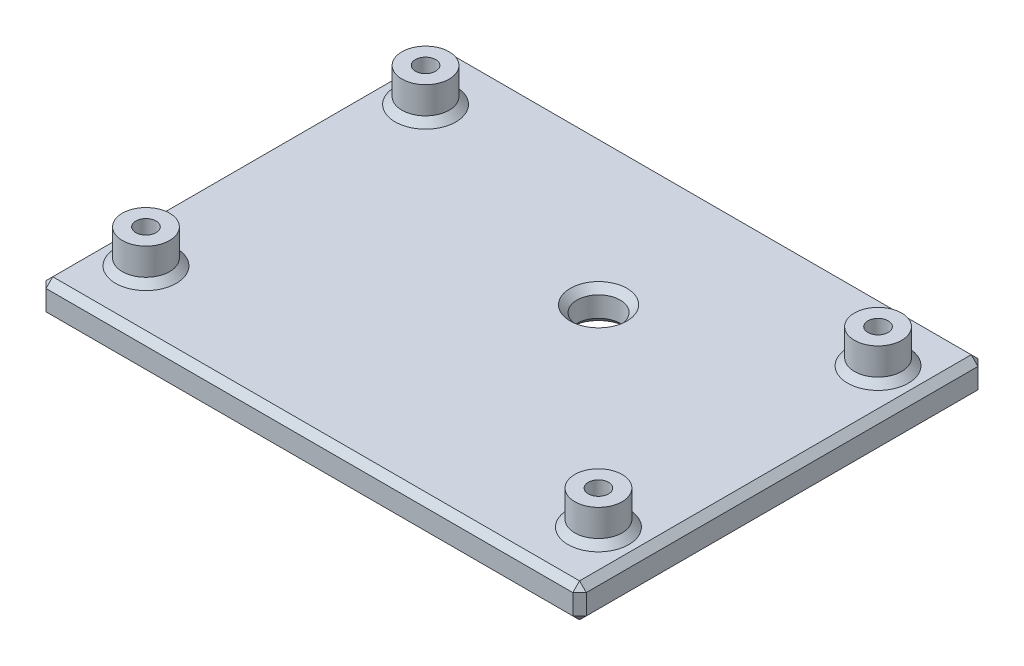
ISO-10303-21;
HEADER;
FILE_DESCRIPTION(('STEP AP214'),'2;1');
FILE_NAME('part.step','',(''),(''),'','','');
FILE_SCHEMA(('AUTOMOTIVE_DESIGN { 1 0 10303 214 1 1 1 1 }'));
ENDSEC;
DATA;
#1=APPLICATION_CONTEXT('core data for automotive mechanical design processes');
#2=APPLICATION_PROTOCOL_DEFINITION('international standard','automotive_design',2000,#1);
#3=PRODUCT_CONTEXT('',#1,'mechanical');
#4=PRODUCT('Part','Part','',(#3));
#5=PRODUCT_RELATED_PRODUCT_CATEGORY('part','',(#4));
#6=PRODUCT_DEFINITION_FORMATION('','',#4);
#7=PRODUCT_DEFINITION_CONTEXT('part definition',#1,'design');
#8=PRODUCT_DEFINITION('design','',#6,#7);
#9=PRODUCT_DEFINITION_SHAPE('','',#8);
#10=(LENGTH_UNIT() NAMED_UNIT(*) SI_UNIT(.MILLI.,.METRE.));
#11=(NAMED_UNIT(*) PLANE_ANGLE_UNIT() SI_UNIT($,.RADIAN.));
#12=(NAMED_UNIT(*) SI_UNIT($,.STERADIAN.) SOLID_ANGLE_UNIT());
#13=UNCERTAINTY_MEASURE_WITH_UNIT(LENGTH_MEASURE(1.E-05),#10,'distance_accuracy_value','');
#14=(GEOMETRIC_REPRESENTATION_CONTEXT(3) GLOBAL_UNCERTAINTY_ASSIGNED_CONTEXT((#13)) GLOBAL_UNIT_ASSIGNED_CONTEXT((#10,
#11,#12)) REPRESENTATION_CONTEXT('',''));
#15=CARTESIAN_POINT('',(0.,0.,0.));
#16=DIRECTION('',(0.,0.,1.));
#17=DIRECTION('',(1.,0.,0.));
#18=AXIS2_PLACEMENT_3D('',#15,#16,#17);
#19=CARTESIAN_POINT('',(40.,5.,30.));
#20=DIRECTION('',(-1.,0.,0.));
#21=DIRECTION('',(0.,0.,1.));
#22=AXIS2_PLACEMENT_3D('',#19,#20,#21);
#23=PLANE('',#22);
#24=DIRECTION('',(0.,1.,0.));
#25=VECTOR('',#24,1.);
#26=CARTESIAN_POINT('',(40.,5.,-29.));
#27=LINE('',#26,#25);
#28=CARTESIAN_POINT('',(40.,1.00000000000001,-29.));
#29=VERTEX_POINT('',#28);
#30=CARTESIAN_POINT('',(40.,3.99999999999999,-29.));
#31=VERTEX_POINT('',#30);
#32=EDGE_CURVE('E45',#29,#31,#27,.T.);
#33=ORIENTED_EDGE('',*,*,#32,.T.);
#34=DIRECTION('',(0.,0.,1.));
#35=VECTOR('',#34,1.);
#36=CARTESIAN_POINT('',(40.,3.99999999999999,30.));
#37=LINE('',#36,#35);
#38=CARTESIAN_POINT('',(40.,3.99999999999999,29.));
#39=VERTEX_POINT('',#38);
#40=EDGE_CURVE('E11',#31,#39,#37,.T.);
#41=ORIENTED_EDGE('',*,*,#40,.T.);
#42=DIRECTION('',(0.,-1.,0.));
#43=VECTOR('',#42,1.);
#44=CARTESIAN_POINT('',(40.,5.,29.));
#45=LINE('',#44,#43);
#46=CARTESIAN_POINT('',(40.,1.00000000000001,29.));
#47=VERTEX_POINT('',#46);
#48=EDGE_CURVE('E254',#39,#47,#45,.T.);
#49=ORIENTED_EDGE('',*,*,#48,.T.);
#50=DIRECTION('',(0.,0.,-1.));
#51=VECTOR('',#50,1.);
#52=CARTESIAN_POINT('',(40.,1.00000000000001,-30.));
#53=LINE('',#52,#51);
#54=EDGE_CURVE('E56',#47,#29,#53,.T.);
#55=ORIENTED_EDGE('',*,*,#54,.T.);
#56=EDGE_LOOP('',(#33,#41,#49,#55));
#57=FACE_BOUND('',#56,.T.);
#58=ADVANCED_FACE('F35',(#57),#23,.F.);
#59=CARTESIAN_POINT('',(-40.,5.,-30.));
#60=DIRECTION('',(0.,0.,1.));
#61=DIRECTION('',(1.,0.,0.));
#62=AXIS2_PLACEMENT_3D('',#59,#60,#61);
#63=PLANE('',#62);
#64=DIRECTION('',(-1.,0.,0.));
#65=VECTOR('',#64,1.);
#66=CARTESIAN_POINT('',(-40.,1.00000000000001,-30.));
#67=LINE('',#66,#65);
#68=CARTESIAN_POINT('',(39.,1.00000000000001,-30.));
#69=VERTEX_POINT('',#68);
#70=CARTESIAN_POINT('',(-39.,1.00000000000001,-30.));
#71=VERTEX_POINT('',#70);
#72=EDGE_CURVE('E239',#69,#71,#67,.T.);
#73=ORIENTED_EDGE('',*,*,#72,.T.);
#74=DIRECTION('',(0.,1.,0.));
#75=VECTOR('',#74,1.);
#76=CARTESIAN_POINT('',(-39.,5.,-30.));
#77=LINE('',#76,#75);
#78=CARTESIAN_POINT('',(-39.,3.99999999999997,-30.));
#79=VERTEX_POINT('',#78);
#80=EDGE_CURVE('E243',#71,#79,#77,.T.);
#81=ORIENTED_EDGE('',*,*,#80,.T.);
#82=DIRECTION('',(1.,0.,0.));
#83=VECTOR('',#82,1.);
#84=CARTESIAN_POINT('',(-40.,3.99999999999997,-30.));
#85=LINE('',#84,#83);
#86=CARTESIAN_POINT('',(39.,3.99999999999997,-30.));
#87=VERTEX_POINT('',#86);
#88=EDGE_CURVE('E241',#79,#87,#85,.T.);
#89=ORIENTED_EDGE('',*,*,#88,.T.);
#90=DIRECTION('',(0.,-1.,0.));
#91=VECTOR('',#90,1.);
#92=CARTESIAN_POINT('',(39.,5.,-30.));
#93=LINE('',#92,#91);
#94=EDGE_CURVE('E237',#87,#69,#93,.T.);
#95=ORIENTED_EDGE('',*,*,#94,.T.);
#96=EDGE_LOOP('',(#73,#81,#89,#95));
#97=FACE_BOUND('',#96,.T.);
#98=ADVANCED_FACE('F387',(#97),#63,.F.);
#99=CARTESIAN_POINT('',(-40.,5.,30.));
#100=DIRECTION('',(1.,0.,0.));
#101=DIRECTION('',(0.,0.,-1.));
#102=AXIS2_PLACEMENT_3D('',#99,#100,#101);
#103=PLANE('',#102);
#104=DIRECTION('',(0.,1.,0.));
#105=VECTOR('',#104,1.);
#106=CARTESIAN_POINT('',(-40.,5.,29.));
#107=LINE('',#106,#105);
#108=CARTESIAN_POINT('',(-40.,1.00000000000001,29.));
#109=VERTEX_POINT('',#108);
#110=CARTESIAN_POINT('',(-40.,3.99999999999997,29.));
#111=VERTEX_POINT('',#110);
#112=EDGE_CURVE('E230',#109,#111,#107,.T.);
#113=ORIENTED_EDGE('',*,*,#112,.T.);
#114=DIRECTION('',(0.,0.,-1.));
#115=VECTOR('',#114,1.);
#116=CARTESIAN_POINT('',(-40.,3.99999999999997,30.));
#117=LINE('',#116,#115);
#118=CARTESIAN_POINT('',(-40.,3.99999999999997,-29.));
#119=VERTEX_POINT('',#118);
#120=EDGE_CURVE('E235',#111,#119,#117,.T.);
#121=ORIENTED_EDGE('',*,*,#120,.T.);
#122=DIRECTION('',(0.,-1.,0.));
#123=VECTOR('',#122,1.);
#124=CARTESIAN_POINT('',(-40.,5.,-29.));
#125=LINE('',#124,#123);
#126=CARTESIAN_POINT('',(-40.,1.00000000000001,-29.));
#127=VERTEX_POINT('',#126);
#128=EDGE_CURVE('E232',#119,#127,#125,.T.);
#129=ORIENTED_EDGE('',*,*,#128,.T.);
#130=DIRECTION('',(0.,0.,1.));
#131=VECTOR('',#130,1.);
#132=CARTESIAN_POINT('',(-40.,1.00000000000001,30.));
#133=LINE('',#132,#131);
#134=EDGE_CURVE('E228',#127,#109,#133,.T.);
#135=ORIENTED_EDGE('',*,*,#134,.T.);
#136=EDGE_LOOP('',(#113,#121,#129,#135));
#137=FACE_BOUND('',#136,.T.);
#138=ADVANCED_FACE('F361',(#137),#103,.F.);
#139=CARTESIAN_POINT('',(-40.,5.,30.));
#140=DIRECTION('',(0.,0.,-1.));
#141=DIRECTION('',(-1.,0.,0.));
#142=AXIS2_PLACEMENT_3D('',#139,#140,#141);
#143=PLANE('',#142);
#144=DIRECTION('',(-1.,0.,0.));
#145=VECTOR('',#144,1.);
#146=CARTESIAN_POINT('',(-40.,3.99999999999997,30.));
#147=LINE('',#146,#145);
#148=CARTESIAN_POINT('',(39.,3.99999999999997,30.));
#149=VERTEX_POINT('',#148);
#150=CARTESIAN_POINT('',(-39.,3.99999999999997,30.));
#151=VERTEX_POINT('',#150);
#152=EDGE_CURVE('E152',#149,#151,#147,.T.);
#153=ORIENTED_EDGE('',*,*,#152,.T.);
#154=DIRECTION('',(0.,-1.,0.));
#155=VECTOR('',#154,1.);
#156=CARTESIAN_POINT('',(-39.,5.,30.));
#157=LINE('',#156,#155);
#158=CARTESIAN_POINT('',(-39.,1.00000000000003,30.));
#159=VERTEX_POINT('',#158);
#160=EDGE_CURVE('E251',#151,#159,#157,.T.);
#161=ORIENTED_EDGE('',*,*,#160,.T.);
#162=DIRECTION('',(1.,0.,0.));
#163=VECTOR('',#162,1.);
#164=CARTESIAN_POINT('',(40.,1.00000000000003,30.));
#165=LINE('',#164,#163);
#166=CARTESIAN_POINT('',(39.,1.00000000000003,30.));
#167=VERTEX_POINT('',#166);
#168=EDGE_CURVE('E248',#159,#167,#165,.T.);
#169=ORIENTED_EDGE('',*,*,#168,.T.);
#170=DIRECTION('',(0.,1.,0.));
#171=VECTOR('',#170,1.);
#172=CARTESIAN_POINT('',(39.,5.,30.));
#173=LINE('',#172,#171);
#174=EDGE_CURVE('E246',#167,#149,#173,.T.);
#175=ORIENTED_EDGE('',*,*,#174,.T.);
#176=EDGE_LOOP('',(#153,#161,#169,#175));
#177=FACE_BOUND('',#176,.T.);
#178=ADVANCED_FACE('F582',(#177),#143,.F.);
#179=CARTESIAN_POINT('',(0.,5.,0.));
#180=DIRECTION('',(0.,-1.,0.));
#181=DIRECTION('',(0.,0.,-1.));
#182=AXIS2_PLACEMENT_3D('',#179,#180,#181);
#183=PLANE('',#182);
#184=CARTESIAN_POINT('',(33.5,5.,-20.7));
#185=DIRECTION('',(0.,-1.,0.));
#186=DIRECTION('',(0.,0.,-1.));
#187=AXIS2_PLACEMENT_3D('',#184,#185,#186);
#188=CIRCLE('',#187,4.49999999999998);
#189=CARTESIAN_POINT('',(33.5,5.,-25.2));
#190=VERTEX_POINT('',#189);
#191=EDGE_CURVE('E174',#190,#190,#188,.T.);
#192=ORIENTED_EDGE('',*,*,#191,.T.);
#193=EDGE_LOOP('',(#192));
#194=FACE_BOUND('',#193,.T.);
#195=CARTESIAN_POINT('',(33.5,5.,20.7));
#196=DIRECTION('',(0.,-1.,0.));
#197=DIRECTION('',(0.,0.,-1.));
#198=AXIS2_PLACEMENT_3D('',#195,#196,#197);
#199=CIRCLE('',#198,4.49999999999998);
#200=CARTESIAN_POINT('',(33.5,5.,16.2));
#201=VERTEX_POINT('',#200);
#202=EDGE_CURVE('E171',#201,#201,#199,.T.);
#203=ORIENTED_EDGE('',*,*,#202,.T.);
#204=EDGE_LOOP('',(#203));
#205=FACE_BOUND('',#204,.T.);
#206=CARTESIAN_POINT('',(-33.5,5.,20.7));
#207=DIRECTION('',(0.,-1.,0.));
#208=DIRECTION('',(0.,0.,-1.));
#209=AXIS2_PLACEMENT_3D('',#206,#207,#208);
#210=CIRCLE('',#209,4.49999999999998);
#211=CARTESIAN_POINT('',(-33.5,5.,16.2));
#212=VERTEX_POINT('',#211);
#213=EDGE_CURVE('E168',#212,#212,#210,.T.);
#214=ORIENTED_EDGE('',*,*,#213,.T.);
#215=EDGE_LOOP('',(#214));
#216=FACE_BOUND('',#215,.T.);
#217=CARTESIAN_POINT('',(-33.5,5.,-20.7));
#218=DIRECTION('',(0.,-1.,0.));
#219=DIRECTION('',(0.,0.,-1.));
#220=AXIS2_PLACEMENT_3D('',#217,#218,#219);
#221=CIRCLE('',#220,4.49999999999998);
#222=CARTESIAN_POINT('',(-33.5,5.,-25.2));
#223=VERTEX_POINT('',#222);
#224=EDGE_CURVE('E161',#223,#223,#221,.T.);
#225=ORIENTED_EDGE('',*,*,#224,.T.);
#226=EDGE_LOOP('',(#225));
#227=FACE_BOUND('',#226,.T.);
#228=CARTESIAN_POINT('',(4.995,5.,-7.825));
#229=DIRECTION('',(0.,-1.,0.));
#230=DIRECTION('',(0.,0.,-1.));
#231=AXIS2_PLACEMENT_3D('',#228,#229,#230);
#232=CIRCLE('',#231,4.20000000000002);
#233=CARTESIAN_POINT('',(4.995,5.,-12.025));
#234=VERTEX_POINT('',#233);
#235=EDGE_CURVE('E158',#234,#234,#232,.T.);
#236=ORIENTED_EDGE('',*,*,#235,.T.);
#237=EDGE_LOOP('',(#236));
#238=FACE_BOUND('',#237,.T.);
#239=DIRECTION('',(0.,0.,1.));
#240=VECTOR('',#239,1.);
#241=CARTESIAN_POINT('',(-39.,5.,0.));
#242=LINE('',#241,#240);
#243=CARTESIAN_POINT('',(-39.,5.,-29.));
#244=VERTEX_POINT('',#243);
#245=CARTESIAN_POINT('',(-39.,5.,29.));
#246=VERTEX_POINT('',#245);
#247=EDGE_CURVE('E157',#244,#246,#242,.T.);
#248=ORIENTED_EDGE('',*,*,#247,.T.);
#249=DIRECTION('',(1.,0.,0.));
#250=VECTOR('',#249,1.);
#251=CARTESIAN_POINT('',(0.,5.,29.));
#252=LINE('',#251,#250);
#253=CARTESIAN_POINT('',(39.,5.,29.));
#254=VERTEX_POINT('',#253);
#255=EDGE_CURVE('E150',#246,#254,#252,.T.);
#256=ORIENTED_EDGE('',*,*,#255,.T.);
#257=DIRECTION('',(0.,0.,-1.));
#258=VECTOR('',#257,1.);
#259=CARTESIAN_POINT('',(39.,5.,0.));
#260=LINE('',#259,#258);
#261=CARTESIAN_POINT('',(39.,5.,-29.));
#262=VERTEX_POINT('',#261);
#263=EDGE_CURVE('E123',#254,#262,#260,.T.);
#264=ORIENTED_EDGE('',*,*,#263,.T.);
#265=DIRECTION('',(-1.,0.,0.));
#266=VECTOR('',#265,1.);
#267=CARTESIAN_POINT('',(0.,5.,-29.));
#268=LINE('',#267,#266);
#269=EDGE_CURVE('E133',#262,#244,#268,.T.);
#270=ORIENTED_EDGE('',*,*,#269,.T.);
#271=EDGE_LOOP('',(#248,#256,#264,#270));
#272=FACE_BOUND('',#271,.T.);
#273=ADVANCED_FACE('F155',(#194,#205,#216,#227,#238,#272),#183,.F.);
#274=CARTESIAN_POINT('',(0.,0.,0.));
#275=DIRECTION('',(0.,-1.,0.));
#276=DIRECTION('',(0.,0.,-1.));
#277=AXIS2_PLACEMENT_3D('',#274,#275,#276);
#278=PLANE('',#277);
#279=CARTESIAN_POINT('',(33.5,0.,20.7));
#280=DIRECTION('',(0.,-1.,0.));
#281=DIRECTION('',(0.,0.,-1.));
#282=AXIS2_PLACEMENT_3D('',#279,#280,#281);
#283=CIRCLE('',#282,2.50000000000002);
#284=CARTESIAN_POINT('',(33.5,0.,18.2));
#285=VERTEX_POINT('',#284);
#286=EDGE_CURVE('E213',#285,#285,#283,.F.);
#287=ORIENTED_EDGE('',*,*,#286,.T.);
#288=EDGE_LOOP('',(#287));
#289=FACE_BOUND('',#288,.T.);
#290=CARTESIAN_POINT('',(4.995,0.,-7.825));
#291=DIRECTION('',(0.,-1.,0.));
#292=DIRECTION('',(0.,0.,-1.));
#293=AXIS2_PLACEMENT_3D('',#290,#291,#292);
#294=CIRCLE('',#293,4.20000000000002);
#295=CARTESIAN_POINT('',(4.995,0.,-12.025));
#296=VERTEX_POINT('',#295);
#297=EDGE_CURVE('E210',#296,#296,#294,.F.);
#298=ORIENTED_EDGE('',*,*,#297,.T.);
#299=EDGE_LOOP('',(#298));
#300=FACE_BOUND('',#299,.T.);
#301=CARTESIAN_POINT('',(-33.5,0.,-20.7));
#302=DIRECTION('',(0.,-1.,0.));
#303=DIRECTION('',(0.,0.,-1.));
#304=AXIS2_PLACEMENT_3D('',#301,#302,#303);
#305=CIRCLE('',#304,2.50000000000002);
#306=CARTESIAN_POINT('',(-33.5,0.,-23.2));
#307=VERTEX_POINT('',#306);
#308=EDGE_CURVE('E207',#307,#307,#305,.F.);
#309=ORIENTED_EDGE('',*,*,#308,.T.);
#310=EDGE_LOOP('',(#309));
#311=FACE_BOUND('',#310,.T.);
#312=CARTESIAN_POINT('',(-33.5,0.,20.7));
#313=DIRECTION('',(0.,-1.,0.));
#314=DIRECTION('',(0.,0.,-1.));
#315=AXIS2_PLACEMENT_3D('',#312,#313,#314);
#316=CIRCLE('',#315,2.50000000000002);
#317=CARTESIAN_POINT('',(-33.5,0.,18.2));
#318=VERTEX_POINT('',#317);
#319=EDGE_CURVE('E204',#318,#318,#316,.F.);
#320=ORIENTED_EDGE('',*,*,#319,.T.);
#321=EDGE_LOOP('',(#320));
#322=FACE_BOUND('',#321,.T.);
#323=CARTESIAN_POINT('',(33.5,0.,-20.7));
#324=DIRECTION('',(0.,-1.,0.));
#325=DIRECTION('',(0.,0.,-1.));
#326=AXIS2_PLACEMENT_3D('',#323,#324,#325);
#327=CIRCLE('',#326,2.50000000000002);
#328=CARTESIAN_POINT('',(33.5,0.,-23.2));
#329=VERTEX_POINT('',#328);
#330=EDGE_CURVE('E201',#329,#329,#327,.F.);
#331=ORIENTED_EDGE('',*,*,#330,.T.);
#332=EDGE_LOOP('',(#331));
#333=FACE_BOUND('',#332,.T.);
#334=DIRECTION('',(0.,0.,-1.));
#335=VECTOR('',#334,1.);
#336=CARTESIAN_POINT('',(-39.,0.,-30.));
#337=LINE('',#336,#335);
#338=CARTESIAN_POINT('',(-39.,0.,29.));
#339=VERTEX_POINT('',#338);
#340=CARTESIAN_POINT('',(-39.,0.,-29.));
#341=VERTEX_POINT('',#340);
#342=EDGE_CURVE('E196',#339,#341,#337,.T.);
#343=ORIENTED_EDGE('',*,*,#342,.T.);
#344=DIRECTION('',(1.,0.,0.));
#345=VECTOR('',#344,1.);
#346=CARTESIAN_POINT('',(40.,0.,-29.));
#347=LINE('',#346,#345);
#348=CARTESIAN_POINT('',(39.,0.,-29.));
#349=VERTEX_POINT('',#348);
#350=EDGE_CURVE('E198',#341,#349,#347,.T.);
#351=ORIENTED_EDGE('',*,*,#350,.T.);
#352=DIRECTION('',(0.,0.,1.));
#353=VECTOR('',#352,1.);
#354=CARTESIAN_POINT('',(39.,0.,30.));
#355=LINE('',#354,#353);
#356=CARTESIAN_POINT('',(39.,0.,29.));
#357=VERTEX_POINT('',#356);
#358=EDGE_CURVE('E192',#349,#357,#355,.T.);
#359=ORIENTED_EDGE('',*,*,#358,.T.);
#360=DIRECTION('',(-1.,0.,0.));
#361=VECTOR('',#360,1.);
#362=CARTESIAN_POINT('',(-40.,0.,29.));
#363=LINE('',#362,#361);
#364=EDGE_CURVE('E194',#357,#339,#363,.T.);
#365=ORIENTED_EDGE('',*,*,#364,.T.);
#366=EDGE_LOOP('',(#343,#351,#359,#365));
#367=FACE_BOUND('',#366,.T.);
#368=ADVANCED_FACE('F589',(#289,#300,#311,#322,#333,#367),#278,.T.);
#369=CARTESIAN_POINT('',(33.5,10.,-20.7));
#370=DIRECTION('',(0.,-1.,0.));
#371=DIRECTION('',(0.,0.,-1.));
#372=AXIS2_PLACEMENT_3D('',#369,#370,#371);
#373=CYLINDRICAL_SURFACE('',#372,3.5);
#374=CARTESIAN_POINT('',(33.5,5.99999999999999,-20.7));
#375=DIRECTION('',(0.,-1.,0.));
#376=DIRECTION('',(0.,0.,-1.));
#377=AXIS2_PLACEMENT_3D('',#374,#375,#376);
#378=CIRCLE('',#377,3.5);
#379=CARTESIAN_POINT('',(33.5,5.99999999999999,-24.2));
#380=VERTEX_POINT('',#379);
#381=EDGE_CURVE('E134',#380,#380,#378,.F.);
#382=ORIENTED_EDGE('',*,*,#381,.T.);
#383=EDGE_LOOP('',(#382));
#384=FACE_BOUND('',#383,.T.);
#385=CARTESIAN_POINT('',(33.5,10.,-20.7));
#386=DIRECTION('',(0.,1.,0.));
#387=DIRECTION('',(0.,0.,1.));
#388=AXIS2_PLACEMENT_3D('',#385,#386,#387);
#389=CIRCLE('',#388,3.5);
#390=CARTESIAN_POINT('',(33.5,10.,-17.2));
#391=VERTEX_POINT('',#390);
#392=EDGE_CURVE('E338',#391,#391,#389,.T.);
#393=ORIENTED_EDGE('',*,*,#392,.F.);
#394=EDGE_LOOP('',(#393));
#395=FACE_BOUND('',#394,.T.);
#396=ADVANCED_FACE('F594',(#384,#395),#373,.T.);
#397=CARTESIAN_POINT('',(33.5,10.,-20.7));
#398=DIRECTION('',(0.,1.,0.));
#399=DIRECTION('',(0.,0.,1.));
#400=AXIS2_PLACEMENT_3D('',#397,#398,#399);
#401=PLANE('',#400);
#402=CARTESIAN_POINT('',(33.5,10.,-20.7));
#403=DIRECTION('',(0.,1.,0.));
#404=DIRECTION('',(0.,0.,1.));
#405=AXIS2_PLACEMENT_3D('',#402,#403,#404);
#406=CIRCLE('',#405,1.5);
#407=CARTESIAN_POINT('',(33.5,10.,-19.2));
#408=VERTEX_POINT('',#407);
#409=EDGE_CURVE('E321',#408,#408,#406,.T.);
#410=ORIENTED_EDGE('',*,*,#409,.F.);
#411=EDGE_LOOP('',(#410));
#412=FACE_BOUND('',#411,.T.);
#413=ORIENTED_EDGE('',*,*,#392,.T.);
#414=EDGE_LOOP('',(#413));
#415=FACE_BOUND('',#414,.T.);
#416=ADVANCED_FACE('F599',(#412,#415),#401,.T.);
#417=CARTESIAN_POINT('',(33.5,10.,20.7));
#418=DIRECTION('',(0.,-1.,0.));
#419=DIRECTION('',(0.,0.,-1.));
#420=AXIS2_PLACEMENT_3D('',#417,#418,#419);
#421=CYLINDRICAL_SURFACE('',#420,3.5);
#422=CARTESIAN_POINT('',(33.5,5.99999999999999,20.7));
#423=DIRECTION('',(0.,-1.,0.));
#424=DIRECTION('',(0.,0.,-1.));
#425=AXIS2_PLACEMENT_3D('',#422,#423,#424);
#426=CIRCLE('',#425,3.5);
#427=CARTESIAN_POINT('',(33.5,5.99999999999999,17.2));
#428=VERTEX_POINT('',#427);
#429=EDGE_CURVE('E177',#428,#428,#426,.F.);
#430=ORIENTED_EDGE('',*,*,#429,.T.);
#431=EDGE_LOOP('',(#430));
#432=FACE_BOUND('',#431,.T.);
#433=CARTESIAN_POINT('',(33.5,10.,20.7));
#434=DIRECTION('',(0.,1.,0.));
#435=DIRECTION('',(0.,0.,1.));
#436=AXIS2_PLACEMENT_3D('',#433,#434,#435);
#437=CIRCLE('',#436,3.5);
#438=CARTESIAN_POINT('',(33.5,10.,24.2));
#439=VERTEX_POINT('',#438);
#440=EDGE_CURVE('E335',#439,#439,#437,.T.);
#441=ORIENTED_EDGE('',*,*,#440,.F.);
#442=EDGE_LOOP('',(#441));
#443=FACE_BOUND('',#442,.T.);
#444=ADVANCED_FACE('F603',(#432,#443),#421,.T.);
#445=CARTESIAN_POINT('',(33.5,10.,20.7));
#446=DIRECTION('',(0.,1.,0.));
#447=DIRECTION('',(0.,0.,1.));
#448=AXIS2_PLACEMENT_3D('',#445,#446,#447);
#449=PLANE('',#448);
#450=CARTESIAN_POINT('',(33.5,10.,20.7));
#451=DIRECTION('',(0.,1.,0.));
#452=DIRECTION('',(0.,0.,1.));
#453=AXIS2_PLACEMENT_3D('',#450,#451,#452);
#454=CIRCLE('',#453,1.5);
#455=CARTESIAN_POINT('',(33.5,10.,22.2));
#456=VERTEX_POINT('',#455);
#457=EDGE_CURVE('E325',#456,#456,#454,.T.);
#458=ORIENTED_EDGE('',*,*,#457,.F.);
#459=EDGE_LOOP('',(#458));
#460=FACE_BOUND('',#459,.T.);
#461=ORIENTED_EDGE('',*,*,#440,.T.);
#462=EDGE_LOOP('',(#461));
#463=FACE_BOUND('',#462,.T.);
#464=ADVANCED_FACE('F607',(#460,#463),#449,.T.);
#465=CARTESIAN_POINT('',(-33.5,10.,20.7));
#466=DIRECTION('',(0.,-1.,0.));
#467=DIRECTION('',(0.,0.,-1.));
#468=AXIS2_PLACEMENT_3D('',#465,#466,#467);
#469=CYLINDRICAL_SURFACE('',#468,3.5);
#470=CARTESIAN_POINT('',(-33.5,5.99999999999999,20.7));
#471=DIRECTION('',(0.,-1.,0.));
#472=DIRECTION('',(0.,0.,-1.));
#473=AXIS2_PLACEMENT_3D('',#470,#471,#472);
#474=CIRCLE('',#473,3.5);
#475=CARTESIAN_POINT('',(-33.5,5.99999999999999,17.2));
#476=VERTEX_POINT('',#475);
#477=EDGE_CURVE('E180',#476,#476,#474,.F.);
#478=ORIENTED_EDGE('',*,*,#477,.T.);
#479=EDGE_LOOP('',(#478));
#480=FACE_BOUND('',#479,.T.);
#481=CARTESIAN_POINT('',(-33.5,10.,20.7));
#482=DIRECTION('',(0.,1.,0.));
#483=DIRECTION('',(0.,0.,1.));
#484=AXIS2_PLACEMENT_3D('',#481,#482,#483);
#485=CIRCLE('',#484,3.5);
#486=CARTESIAN_POINT('',(-33.5,10.,24.2));
#487=VERTEX_POINT('',#486);
#488=EDGE_CURVE('E332',#487,#487,#485,.T.);
#489=ORIENTED_EDGE('',*,*,#488,.F.);
#490=EDGE_LOOP('',(#489));
#491=FACE_BOUND('',#490,.T.);
#492=ADVANCED_FACE('F611',(#480,#491),#469,.T.);
#493=CARTESIAN_POINT('',(-33.5,10.,20.7));
#494=DIRECTION('',(0.,1.,0.));
#495=DIRECTION('',(0.,0.,1.));
#496=AXIS2_PLACEMENT_3D('',#493,#494,#495);
#497=PLANE('',#496);
#498=CARTESIAN_POINT('',(-33.5,10.,20.7));
#499=DIRECTION('',(0.,1.,0.));
#500=DIRECTION('',(0.,0.,1.));
#501=AXIS2_PLACEMENT_3D('',#498,#499,#500);
#502=CIRCLE('',#501,1.5);
#503=CARTESIAN_POINT('',(-33.5,10.,22.2));
#504=VERTEX_POINT('',#503);
#505=EDGE_CURVE('E316',#504,#504,#502,.T.);
#506=ORIENTED_EDGE('',*,*,#505,.F.);
#507=EDGE_LOOP('',(#506));
#508=FACE_BOUND('',#507,.T.);
#509=ORIENTED_EDGE('',*,*,#488,.T.);
#510=EDGE_LOOP('',(#509));
#511=FACE_BOUND('',#510,.T.);
#512=ADVANCED_FACE('F615',(#508,#511),#497,.T.);
#513=CARTESIAN_POINT('',(-33.5,10.,-20.7));
#514=DIRECTION('',(0.,-1.,0.));
#515=DIRECTION('',(0.,0.,-1.));
#516=AXIS2_PLACEMENT_3D('',#513,#514,#515);
#517=CYLINDRICAL_SURFACE('',#516,3.5);
#518=CARTESIAN_POINT('',(-33.5,5.99999999999999,-20.7));
#519=DIRECTION('',(0.,-1.,0.));
#520=DIRECTION('',(0.,0.,-1.));
#521=AXIS2_PLACEMENT_3D('',#518,#519,#520);
#522=CIRCLE('',#521,3.5);
#523=CARTESIAN_POINT('',(-33.5,5.99999999999999,-24.2));
#524=VERTEX_POINT('',#523);
#525=EDGE_CURVE('E183',#524,#524,#522,.F.);
#526=ORIENTED_EDGE('',*,*,#525,.T.);
#527=EDGE_LOOP('',(#526));
#528=FACE_BOUND('',#527,.T.);
#529=CARTESIAN_POINT('',(-33.5,10.,-20.7));
#530=DIRECTION('',(0.,1.,0.));
#531=DIRECTION('',(0.,0.,1.));
#532=AXIS2_PLACEMENT_3D('',#529,#530,#531);
#533=CIRCLE('',#532,3.5);
#534=CARTESIAN_POINT('',(-33.5,10.,-17.2));
#535=VERTEX_POINT('',#534);
#536=EDGE_CURVE('E329',#535,#535,#533,.T.);
#537=ORIENTED_EDGE('',*,*,#536,.F.);
#538=EDGE_LOOP('',(#537));
#539=FACE_BOUND('',#538,.T.);
#540=ADVANCED_FACE('F619',(#528,#539),#517,.T.);
#541=CARTESIAN_POINT('',(-33.5,10.,-20.7));
#542=DIRECTION('',(0.,1.,0.));
#543=DIRECTION('',(0.,0.,1.));
#544=AXIS2_PLACEMENT_3D('',#541,#542,#543);
#545=PLANE('',#544);
#546=CARTESIAN_POINT('',(-33.5,10.,-20.7));
#547=DIRECTION('',(0.,1.,0.));
#548=DIRECTION('',(0.,0.,1.));
#549=AXIS2_PLACEMENT_3D('',#546,#547,#548);
#550=CIRCLE('',#549,1.5);
#551=CARTESIAN_POINT('',(-33.5,10.,-19.2));
#552=VERTEX_POINT('',#551);
#553=EDGE_CURVE('E314',#552,#552,#550,.T.);
#554=ORIENTED_EDGE('',*,*,#553,.F.);
#555=EDGE_LOOP('',(#554));
#556=FACE_BOUND('',#555,.T.);
#557=ORIENTED_EDGE('',*,*,#536,.T.);
#558=EDGE_LOOP('',(#557));
#559=FACE_BOUND('',#558,.T.);
#560=ADVANCED_FACE('F623',(#556,#559),#545,.T.);
#561=CARTESIAN_POINT('',(-33.5,10.,-20.7));
#562=DIRECTION('',(0.,-1.,0.));
#563=DIRECTION('',(0.,0.,-1.));
#564=AXIS2_PLACEMENT_3D('',#561,#562,#563);
#565=CYLINDRICAL_SURFACE('',#564,1.5);
#566=CARTESIAN_POINT('',(-33.5,1.00000000000002,-20.7));
#567=DIRECTION('',(0.,-1.,0.));
#568=DIRECTION('',(0.,0.,-1.));
#569=AXIS2_PLACEMENT_3D('',#566,#567,#568);
#570=CIRCLE('',#569,1.5);
#571=CARTESIAN_POINT('',(-33.5,1.00000000000002,-22.2));
#572=VERTEX_POINT('',#571);
#573=EDGE_CURVE('E219',#572,#572,#570,.T.);
#574=ORIENTED_EDGE('',*,*,#573,.T.);
#575=EDGE_LOOP('',(#574));
#576=FACE_BOUND('',#575,.T.);
#577=ORIENTED_EDGE('',*,*,#553,.T.);
#578=EDGE_LOOP('',(#577));
#579=FACE_BOUND('',#578,.T.);
#580=ADVANCED_FACE('F627',(#576,#579),#565,.F.);
#581=CARTESIAN_POINT('',(-33.5,10.,20.7));
#582=DIRECTION('',(0.,-1.,0.));
#583=DIRECTION('',(0.,0.,-1.));
#584=AXIS2_PLACEMENT_3D('',#581,#582,#583);
#585=CYLINDRICAL_SURFACE('',#584,1.5);
#586=CARTESIAN_POINT('',(-33.5,1.00000000000002,20.7));
#587=DIRECTION('',(0.,-1.,0.));
#588=DIRECTION('',(0.,0.,-1.));
#589=AXIS2_PLACEMENT_3D('',#586,#587,#588);
#590=CIRCLE('',#589,1.5);
#591=CARTESIAN_POINT('',(-33.5,1.00000000000002,19.2));
#592=VERTEX_POINT('',#591);
#593=EDGE_CURVE('E222',#592,#592,#590,.T.);
#594=ORIENTED_EDGE('',*,*,#593,.T.);
#595=EDGE_LOOP('',(#594));
#596=FACE_BOUND('',#595,.T.);
#597=ORIENTED_EDGE('',*,*,#505,.T.);
#598=EDGE_LOOP('',(#597));
#599=FACE_BOUND('',#598,.T.);
#600=ADVANCED_FACE('F633',(#596,#599),#585,.F.);
#601=CARTESIAN_POINT('',(33.5,10.,20.7));
#602=DIRECTION('',(0.,-1.,0.));
#603=DIRECTION('',(0.,0.,-1.));
#604=AXIS2_PLACEMENT_3D('',#601,#602,#603);
#605=CYLINDRICAL_SURFACE('',#604,1.5);
#606=CARTESIAN_POINT('',(33.5,1.00000000000002,20.7));
#607=DIRECTION('',(0.,-1.,0.));
#608=DIRECTION('',(0.,0.,-1.));
#609=AXIS2_PLACEMENT_3D('',#606,#607,#608);
#610=CIRCLE('',#609,1.5);
#611=CARTESIAN_POINT('',(33.5,1.00000000000002,19.2));
#612=VERTEX_POINT('',#611);
#613=EDGE_CURVE('E216',#612,#612,#610,.T.);
#614=ORIENTED_EDGE('',*,*,#613,.T.);
#615=EDGE_LOOP('',(#614));
#616=FACE_BOUND('',#615,.T.);
#617=ORIENTED_EDGE('',*,*,#457,.T.);
#618=EDGE_LOOP('',(#617));
#619=FACE_BOUND('',#618,.T.);
#620=ADVANCED_FACE('F629',(#616,#619),#605,.F.);
#621=CARTESIAN_POINT('',(33.5,10.,-20.7));
#622=DIRECTION('',(0.,-1.,0.));
#623=DIRECTION('',(0.,0.,-1.));
#624=AXIS2_PLACEMENT_3D('',#621,#622,#623);
#625=CYLINDRICAL_SURFACE('',#624,1.5);
#626=CARTESIAN_POINT('',(33.5,1.00000000000002,-20.7));
#627=DIRECTION('',(0.,-1.,0.));
#628=DIRECTION('',(0.,0.,-1.));
#629=AXIS2_PLACEMENT_3D('',#626,#627,#628);
#630=CIRCLE('',#629,1.5);
#631=CARTESIAN_POINT('',(33.5,1.00000000000002,-22.2));
#632=VERTEX_POINT('',#631);
#633=EDGE_CURVE('E225',#632,#632,#630,.T.);
#634=ORIENTED_EDGE('',*,*,#633,.T.);
#635=EDGE_LOOP('',(#634));
#636=FACE_BOUND('',#635,.T.);
#637=ORIENTED_EDGE('',*,*,#409,.T.);
#638=EDGE_LOOP('',(#637));
#639=FACE_BOUND('',#638,.T.);
#640=ADVANCED_FACE('F632',(#636,#639),#625,.F.);
#641=CARTESIAN_POINT('',(4.995,10.,-7.825));
#642=DIRECTION('',(0.,-1.,0.));
#643=DIRECTION('',(0.,0.,-1.));
#644=AXIS2_PLACEMENT_3D('',#641,#642,#643);
#645=CYLINDRICAL_SURFACE('',#644,3.2);
#646=CARTESIAN_POINT('',(4.995,4.,-7.825));
#647=DIRECTION('',(0.,-1.,0.));
#648=DIRECTION('',(0.,0.,-1.));
#649=AXIS2_PLACEMENT_3D('',#646,#647,#648);
#650=CIRCLE('',#649,3.2);
#651=CARTESIAN_POINT('',(4.995,4.,-11.025));
#652=VERTEX_POINT('',#651);
#653=EDGE_CURVE('E189',#652,#652,#650,.F.);
#654=ORIENTED_EDGE('',*,*,#653,.T.);
#655=EDGE_LOOP('',(#654));
#656=FACE_BOUND('',#655,.T.);
#657=CARTESIAN_POINT('',(4.995,1.00000000000002,-7.825));
#658=DIRECTION('',(0.,-1.,0.));
#659=DIRECTION('',(0.,0.,-1.));
#660=AXIS2_PLACEMENT_3D('',#657,#658,#659);
#661=CIRCLE('',#660,3.2);
#662=CARTESIAN_POINT('',(4.995,1.00000000000002,-11.025));
#663=VERTEX_POINT('',#662);
#664=EDGE_CURVE('E186',#663,#663,#661,.T.);
#665=ORIENTED_EDGE('',*,*,#664,.T.);
#666=EDGE_LOOP('',(#665));
#667=FACE_BOUND('',#666,.T.);
#668=ADVANCED_FACE('F404',(#656,#667),#645,.F.);
#669=CARTESIAN_POINT('',(33.5,5.99999999999999,-20.7));
#670=DIRECTION('',(0.,-1.,0.));
#671=DIRECTION('',(0.,0.,-1.));
#672=AXIS2_PLACEMENT_3D('',#669,#670,#671);
#673=CONICAL_SURFACE('',#672,3.5,0.785398163397438);
#674=ORIENTED_EDGE('',*,*,#191,.F.);
#675=EDGE_LOOP('',(#674));
#676=FACE_BOUND('',#675,.T.);
#677=ORIENTED_EDGE('',*,*,#381,.F.);
#678=EDGE_LOOP('',(#677));
#679=FACE_BOUND('',#678,.T.);
#680=ADVANCED_FACE('F397',(#676,#679),#673,.T.);
#681=CARTESIAN_POINT('',(33.5,5.99999999999999,20.7));
#682=DIRECTION('',(0.,-1.,0.));
#683=DIRECTION('',(0.,0.,-1.));
#684=AXIS2_PLACEMENT_3D('',#681,#682,#683);
#685=CONICAL_SURFACE('',#684,3.5,0.785398163397438);
#686=ORIENTED_EDGE('',*,*,#202,.F.);
#687=EDGE_LOOP('',(#686));
#688=FACE_BOUND('',#687,.T.);
#689=ORIENTED_EDGE('',*,*,#429,.F.);
#690=EDGE_LOOP('',(#689));
#691=FACE_BOUND('',#690,.T.);
#692=ADVANCED_FACE('F403',(#688,#691),#685,.T.);
#693=CARTESIAN_POINT('',(-33.5,5.99999999999999,20.7));
#694=DIRECTION('',(0.,-1.,0.));
#695=DIRECTION('',(0.,0.,-1.));
#696=AXIS2_PLACEMENT_3D('',#693,#694,#695);
#697=CONICAL_SURFACE('',#696,3.5,0.785398163397438);
#698=ORIENTED_EDGE('',*,*,#213,.F.);
#699=EDGE_LOOP('',(#698));
#700=FACE_BOUND('',#699,.T.);
#701=ORIENTED_EDGE('',*,*,#477,.F.);
#702=EDGE_LOOP('',(#701));
#703=FACE_BOUND('',#702,.T.);
#704=ADVANCED_FACE('F411',(#700,#703),#697,.T.);
#705=CARTESIAN_POINT('',(-33.5,5.99999999999999,-20.7));
#706=DIRECTION('',(0.,-1.,0.));
#707=DIRECTION('',(0.,0.,-1.));
#708=AXIS2_PLACEMENT_3D('',#705,#706,#707);
#709=CONICAL_SURFACE('',#708,3.5,0.785398163397438);
#710=ORIENTED_EDGE('',*,*,#224,.F.);
#711=EDGE_LOOP('',(#710));
#712=FACE_BOUND('',#711,.T.);
#713=ORIENTED_EDGE('',*,*,#525,.F.);
#714=EDGE_LOOP('',(#713));
#715=FACE_BOUND('',#714,.T.);
#716=ADVANCED_FACE('F418',(#712,#715),#709,.T.);
#717=CARTESIAN_POINT('',(4.995,4.,-7.825));
#718=DIRECTION('',(0.,1.,0.));
#719=DIRECTION('',(0.,0.,1.));
#720=AXIS2_PLACEMENT_3D('',#717,#718,#719);
#721=CONICAL_SURFACE('',#720,3.2,0.785398163397457);
#722=ORIENTED_EDGE('',*,*,#235,.F.);
#723=EDGE_LOOP('',(#722));
#724=FACE_BOUND('',#723,.T.);
#725=ORIENTED_EDGE('',*,*,#653,.F.);
#726=EDGE_LOOP('',(#725));
#727=FACE_BOUND('',#726,.T.);
#728=ADVANCED_FACE('F425',(#724,#727),#721,.F.);
#729=CARTESIAN_POINT('',(33.5,0.,20.7));
#730=DIRECTION('',(0.,-1.,0.));
#731=DIRECTION('',(0.,0.,-1.));
#732=AXIS2_PLACEMENT_3D('',#729,#730,#731);
#733=CONICAL_SURFACE('',#732,2.50000000000002,0.785398163397444);
#734=ORIENTED_EDGE('',*,*,#613,.F.);
#735=EDGE_LOOP('',(#734));
#736=FACE_BOUND('',#735,.T.);
#737=ORIENTED_EDGE('',*,*,#286,.F.);
#738=EDGE_LOOP('',(#737));
#739=FACE_BOUND('',#738,.T.);
#740=ADVANCED_FACE('F432',(#736,#739),#733,.F.);
#741=CARTESIAN_POINT('',(4.995,0.,-7.825));
#742=DIRECTION('',(0.,-1.,0.));
#743=DIRECTION('',(0.,0.,-1.));
#744=AXIS2_PLACEMENT_3D('',#741,#742,#743);
#745=CONICAL_SURFACE('',#744,4.20000000000002,0.785398163397447);
#746=ORIENTED_EDGE('',*,*,#664,.F.);
#747=EDGE_LOOP('',(#746));
#748=FACE_BOUND('',#747,.T.);
#749=ORIENTED_EDGE('',*,*,#297,.F.);
#750=EDGE_LOOP('',(#749));
#751=FACE_BOUND('',#750,.T.);
#752=ADVANCED_FACE('F439',(#748,#751),#745,.F.);
#753=CARTESIAN_POINT('',(-33.5,0.,-20.7));
#754=DIRECTION('',(0.,-1.,0.));
#755=DIRECTION('',(0.,0.,-1.));
#756=AXIS2_PLACEMENT_3D('',#753,#754,#755);
#757=CONICAL_SURFACE('',#756,2.50000000000002,0.785398163397444);
#758=ORIENTED_EDGE('',*,*,#573,.F.);
#759=EDGE_LOOP('',(#758));
#760=FACE_BOUND('',#759,.T.);
#761=ORIENTED_EDGE('',*,*,#308,.F.);
#762=EDGE_LOOP('',(#761));
#763=FACE_BOUND('',#762,.T.);
#764=ADVANCED_FACE('F446',(#760,#763),#757,.F.);
#765=CARTESIAN_POINT('',(-33.5,0.,20.7));
#766=DIRECTION('',(0.,-1.,0.));
#767=DIRECTION('',(0.,0.,-1.));
#768=AXIS2_PLACEMENT_3D('',#765,#766,#767);
#769=CONICAL_SURFACE('',#768,2.50000000000002,0.785398163397444);
#770=ORIENTED_EDGE('',*,*,#593,.F.);
#771=EDGE_LOOP('',(#770));
#772=FACE_BOUND('',#771,.T.);
#773=ORIENTED_EDGE('',*,*,#319,.F.);
#774=EDGE_LOOP('',(#773));
#775=FACE_BOUND('',#774,.T.);
#776=ADVANCED_FACE('F453',(#772,#775),#769,.F.);
#777=CARTESIAN_POINT('',(33.5,0.,-20.7));
#778=DIRECTION('',(0.,-1.,0.));
#779=DIRECTION('',(0.,0.,-1.));
#780=AXIS2_PLACEMENT_3D('',#777,#778,#779);
#781=CONICAL_SURFACE('',#780,2.50000000000002,0.785398163397444);
#782=ORIENTED_EDGE('',*,*,#633,.F.);
#783=EDGE_LOOP('',(#782));
#784=FACE_BOUND('',#783,.T.);
#785=ORIENTED_EDGE('',*,*,#330,.F.);
#786=EDGE_LOOP('',(#785));
#787=FACE_BOUND('',#786,.T.);
#788=ADVANCED_FACE('F460',(#784,#787),#781,.F.);
#789=CARTESIAN_POINT('',(40.,5.,29.));
#790=DIRECTION('',(-0.707106781186543,0.,-0.707106781186552));
#791=DIRECTION('',(0.,-1.,0.));
#792=AXIS2_PLACEMENT_3D('',#789,#790,#791);
#793=PLANE('',#792);
#794=DIRECTION('',(-0.707106781186552,0.,0.707106781186543));
#795=VECTOR('',#794,1.);
#796=CARTESIAN_POINT('',(39.5,3.99999999999998,29.5));
#797=LINE('',#796,#795);
#798=EDGE_CURVE('E40',#149,#39,#797,.F.);
#799=ORIENTED_EDGE('',*,*,#798,.F.);
#800=ORIENTED_EDGE('',*,*,#174,.F.);
#801=DIRECTION('',(0.707106781186552,0.,-0.707106781186543));
#802=VECTOR('',#801,1.);
#803=CARTESIAN_POINT('',(39.,1.00000000000003,30.));
#804=LINE('',#803,#802);
#805=EDGE_CURVE('E144',#47,#167,#804,.F.);
#806=ORIENTED_EDGE('',*,*,#805,.F.);
#807=ORIENTED_EDGE('',*,*,#48,.F.);
#808=EDGE_LOOP('',(#799,#800,#806,#807));
#809=FACE_BOUND('',#808,.T.);
#810=ADVANCED_FACE('F38',(#809),#793,.F.);
#811=CARTESIAN_POINT('',(39.,5.,29.));
#812=DIRECTION('',(0.577350269189618,0.577350269189626,0.577350269189634));
#813=DIRECTION('',(0.,-0.707106781186552,0.707106781186543));
#814=AXIS2_PLACEMENT_3D('',#811,#812,#813);
#815=PLANE('',#814);
#816=DIRECTION('',(0.,0.707106781186552,-0.707106781186543));
#817=VECTOR('',#816,1.);
#818=CARTESIAN_POINT('',(39.,5.,29.));
#819=LINE('',#818,#817);
#820=EDGE_CURVE('E140',#149,#254,#819,.T.);
#821=ORIENTED_EDGE('',*,*,#820,.F.);
#822=ORIENTED_EDGE('',*,*,#798,.T.);
#823=DIRECTION('',(0.707106781186552,-0.707106781186543,0.));
#824=VECTOR('',#823,1.);
#825=CARTESIAN_POINT('',(39.,5.,29.));
#826=LINE('',#825,#824);
#827=EDGE_CURVE('E126',#254,#39,#826,.T.);
#828=ORIENTED_EDGE('',*,*,#827,.F.);
#829=EDGE_LOOP('',(#821,#822,#828));
#830=FACE_BOUND('',#829,.T.);
#831=ADVANCED_FACE('F139',(#830),#815,.T.);
#832=CARTESIAN_POINT('',(39.,1.00000000000003,30.));
#833=DIRECTION('',(0.577350269189618,-0.577350269189626,0.577350269189634));
#834=DIRECTION('',(0.,-0.707106781186552,-0.707106781186543));
#835=AXIS2_PLACEMENT_3D('',#832,#833,#834);
#836=PLANE('',#835);
#837=DIRECTION('',(0.707106781186552,0.707106781186543,0.));
#838=VECTOR('',#837,1.);
#839=CARTESIAN_POINT('',(39.5,0.500000000000007,29.));
#840=LINE('',#839,#838);
#841=EDGE_CURVE('E305',#47,#357,#840,.F.);
#842=ORIENTED_EDGE('',*,*,#841,.F.);
#843=ORIENTED_EDGE('',*,*,#805,.T.);
#844=DIRECTION('',(0.,-0.707106781186552,-0.707106781186543));
#845=VECTOR('',#844,1.);
#846=CARTESIAN_POINT('',(39.,1.00000000000003,30.));
#847=LINE('',#846,#845);
#848=EDGE_CURVE('E153',#357,#167,#847,.F.);
#849=ORIENTED_EDGE('',*,*,#848,.F.);
#850=EDGE_LOOP('',(#842,#843,#849));
#851=FACE_BOUND('',#850,.T.);
#852=ADVANCED_FACE('F552',(#851),#836,.T.);
#853=CARTESIAN_POINT('',(39.,5.,0.));
#854=DIRECTION('',(-0.707106781186543,-0.707106781186552,0.));
#855=DIRECTION('',(0.,0.,-1.));
#856=AXIS2_PLACEMENT_3D('',#853,#854,#855);
#857=PLANE('',#856);
#858=ORIENTED_EDGE('',*,*,#827,.T.);
#859=ORIENTED_EDGE('',*,*,#40,.F.);
#860=DIRECTION('',(-0.707106781186552,0.707106781186543,0.));
#861=VECTOR('',#860,1.);
#862=CARTESIAN_POINT('',(39.5,4.49999999999999,-29.));
#863=LINE('',#862,#861);
#864=EDGE_CURVE('E129',#262,#31,#863,.F.);
#865=ORIENTED_EDGE('',*,*,#864,.F.);
#866=ORIENTED_EDGE('',*,*,#263,.F.);
#867=EDGE_LOOP('',(#858,#859,#865,#866));
#868=FACE_BOUND('',#867,.T.);
#869=ADVANCED_FACE('F125',(#868),#857,.F.);
#870=CARTESIAN_POINT('',(0.,5.,29.));
#871=DIRECTION('',(0.,-0.707106781186543,-0.707106781186552));
#872=DIRECTION('',(1.,0.,0.));
#873=AXIS2_PLACEMENT_3D('',#870,#871,#872);
#874=PLANE('',#873);
#875=ORIENTED_EDGE('',*,*,#820,.T.);
#876=ORIENTED_EDGE('',*,*,#255,.F.);
#877=DIRECTION('',(0.,-0.707106781186552,0.707106781186543));
#878=VECTOR('',#877,1.);
#879=CARTESIAN_POINT('',(-39.,4.49999999999999,29.5));
#880=LINE('',#879,#878);
#881=EDGE_CURVE('E299',#151,#246,#880,.F.);
#882=ORIENTED_EDGE('',*,*,#881,.F.);
#883=ORIENTED_EDGE('',*,*,#152,.F.);
#884=EDGE_LOOP('',(#875,#876,#882,#883));
#885=FACE_BOUND('',#884,.T.);
#886=ADVANCED_FACE('F148',(#885),#874,.F.);
#887=CARTESIAN_POINT('',(-39.,5.,30.));
#888=DIRECTION('',(0.707106781186543,0.,-0.707106781186552));
#889=DIRECTION('',(0.,-1.,0.));
#890=AXIS2_PLACEMENT_3D('',#887,#888,#889);
#891=PLANE('',#890);
#892=DIRECTION('',(0.707106781186552,0.,0.707106781186543));
#893=VECTOR('',#892,1.);
#894=CARTESIAN_POINT('',(-39.,1.00000000000003,30.));
#895=LINE('',#894,#893);
#896=EDGE_CURVE('E293',#159,#109,#895,.F.);
#897=ORIENTED_EDGE('',*,*,#896,.F.);
#898=ORIENTED_EDGE('',*,*,#160,.F.);
#899=DIRECTION('',(-0.707106781186552,0.,-0.707106781186543));
#900=VECTOR('',#899,1.);
#901=CARTESIAN_POINT('',(-40.,3.99999999999997,29.));
#902=LINE('',#901,#900);
#903=EDGE_CURVE('E296',#111,#151,#902,.F.);
#904=ORIENTED_EDGE('',*,*,#903,.F.);
#905=ORIENTED_EDGE('',*,*,#112,.F.);
#906=EDGE_LOOP('',(#897,#898,#904,#905));
#907=FACE_BOUND('',#906,.T.);
#908=ADVANCED_FACE('F368',(#907),#891,.F.);
#909=CARTESIAN_POINT('',(-40.,1.00000000000003,30.));
#910=DIRECTION('',(0.,-0.707106781186543,0.707106781186552));
#911=DIRECTION('',(-1.,0.,0.));
#912=AXIS2_PLACEMENT_3D('',#909,#910,#911);
#913=PLANE('',#912);
#914=ORIENTED_EDGE('',*,*,#848,.T.);
#915=ORIENTED_EDGE('',*,*,#168,.F.);
#916=DIRECTION('',(0.,0.707106781186552,0.707106781186543));
#917=VECTOR('',#916,1.);
#918=CARTESIAN_POINT('',(-39.,1.00000000000003,30.));
#919=LINE('',#918,#917);
#920=EDGE_CURVE('E291',#339,#159,#919,.T.);
#921=ORIENTED_EDGE('',*,*,#920,.F.);
#922=ORIENTED_EDGE('',*,*,#364,.F.);
#923=EDGE_LOOP('',(#914,#915,#921,#922));
#924=FACE_BOUND('',#923,.T.);
#925=ADVANCED_FACE('F535',(#924),#913,.T.);
#926=CARTESIAN_POINT('',(40.,1.00000000000001,30.));
#927=DIRECTION('',(0.707106781186543,-0.707106781186552,0.));
#928=DIRECTION('',(0.,0.,1.));
#929=AXIS2_PLACEMENT_3D('',#926,#927,#928);
#930=PLANE('',#929);
#931=ORIENTED_EDGE('',*,*,#841,.T.);
#932=ORIENTED_EDGE('',*,*,#358,.F.);
#933=DIRECTION('',(-0.707106781186552,-0.707106781186543,0.));
#934=VECTOR('',#933,1.);
#935=CARTESIAN_POINT('',(39.,0.,-29.));
#936=LINE('',#935,#934);
#937=EDGE_CURVE('E288',#29,#349,#936,.T.);
#938=ORIENTED_EDGE('',*,*,#937,.F.);
#939=ORIENTED_EDGE('',*,*,#54,.F.);
#940=EDGE_LOOP('',(#931,#932,#938,#939));
#941=FACE_BOUND('',#940,.T.);
#942=ADVANCED_FACE('F530',(#941),#930,.T.);
#943=CARTESIAN_POINT('',(39.,5.,-30.));
#944=DIRECTION('',(-0.707106781186544,0.,0.707106781186551));
#945=DIRECTION('',(0.,-1.,0.));
#946=AXIS2_PLACEMENT_3D('',#943,#944,#945);
#947=PLANE('',#946);
#948=DIRECTION('',(0.707106781186551,0.,0.707106781186544));
#949=VECTOR('',#948,1.);
#950=CARTESIAN_POINT('',(39.,3.99999999999997,-30.));
#951=LINE('',#950,#949);
#952=EDGE_CURVE('E302',#31,#87,#951,.F.);
#953=ORIENTED_EDGE('',*,*,#952,.F.);
#954=ORIENTED_EDGE('',*,*,#32,.F.);
#955=DIRECTION('',(-0.707106781186551,0.,-0.707106781186544));
#956=VECTOR('',#955,1.);
#957=CARTESIAN_POINT('',(39.5,1.00000000000001,-29.5));
#958=LINE('',#957,#956);
#959=EDGE_CURVE('E285',#69,#29,#958,.F.);
#960=ORIENTED_EDGE('',*,*,#959,.F.);
#961=ORIENTED_EDGE('',*,*,#94,.F.);
#962=EDGE_LOOP('',(#953,#954,#960,#961));
#963=FACE_BOUND('',#962,.T.);
#964=ADVANCED_FACE('F382',(#963),#947,.F.);
#965=CARTESIAN_POINT('',(39.,3.99999999999997,-30.));
#966=DIRECTION('',(0.577350269189619,0.577350269189625,-0.577350269189633));
#967=DIRECTION('',(0.,0.707106781186552,0.707106781186542));
#968=AXIS2_PLACEMENT_3D('',#965,#966,#967);
#969=PLANE('',#968);
#970=ORIENTED_EDGE('',*,*,#864,.T.);
#971=ORIENTED_EDGE('',*,*,#952,.T.);
#972=DIRECTION('',(0.,-0.707106781186552,-0.707106781186543));
#973=VECTOR('',#972,1.);
#974=CARTESIAN_POINT('',(39.,3.99999999999997,-30.));
#975=LINE('',#974,#973);
#976=EDGE_CURVE('E282',#262,#87,#975,.T.);
#977=ORIENTED_EDGE('',*,*,#976,.F.);
#978=EDGE_LOOP('',(#970,#971,#977));
#979=FACE_BOUND('',#978,.T.);
#980=ADVANCED_FACE('F373',(#979),#969,.T.);
#981=CARTESIAN_POINT('',(-40.,3.99999999999997,29.));
#982=DIRECTION('',(-0.577350269189626,0.577350269189618,0.577350269189634));
#983=DIRECTION('',(0.707106781186552,0.,0.707106781186543));
#984=AXIS2_PLACEMENT_3D('',#981,#982,#983);
#985=PLANE('',#984);
#986=ORIENTED_EDGE('',*,*,#903,.T.);
#987=ORIENTED_EDGE('',*,*,#881,.T.);
#988=DIRECTION('',(0.707106781186543,0.707106781186552,0.));
#989=VECTOR('',#988,1.);
#990=CARTESIAN_POINT('',(-40.,3.99999999999997,29.));
#991=LINE('',#990,#989);
#992=EDGE_CURVE('E279',#111,#246,#991,.T.);
#993=ORIENTED_EDGE('',*,*,#992,.F.);
#994=EDGE_LOOP('',(#986,#987,#993));
#995=FACE_BOUND('',#994,.T.);
#996=ADVANCED_FACE('F370',(#995),#985,.T.);
#997=CARTESIAN_POINT('',(-39.,1.00000000000003,30.));
#998=DIRECTION('',(-0.577350269189618,-0.577350269189626,0.577350269189634));
#999=DIRECTION('',(0.,-0.707106781186552,-0.707106781186543));
#1000=AXIS2_PLACEMENT_3D('',#997,#998,#999);
#1001=PLANE('',#1000);
#1002=ORIENTED_EDGE('',*,*,#920,.T.);
#1003=ORIENTED_EDGE('',*,*,#896,.T.);
#1004=DIRECTION('',(0.707106781186552,-0.707106781186543,0.));
#1005=VECTOR('',#1004,1.);
#1006=CARTESIAN_POINT('',(-39.5,0.500000000000007,29.));
#1007=LINE('',#1006,#1005);
#1008=EDGE_CURVE('E276',#339,#109,#1007,.F.);
#1009=ORIENTED_EDGE('',*,*,#1008,.F.);
#1010=EDGE_LOOP('',(#1002,#1003,#1009));
#1011=FACE_BOUND('',#1010,.T.);
#1012=ADVANCED_FACE('F372',(#1011),#1001,.T.);
#1013=CARTESIAN_POINT('',(39.,0.,-29.));
#1014=DIRECTION('',(0.577350269189619,-0.577350269189633,-0.577350269189625));
#1015=DIRECTION('',(0.,0.707106781186542,-0.707106781186552));
#1016=AXIS2_PLACEMENT_3D('',#1013,#1014,#1015);
#1017=PLANE('',#1016);
#1018=ORIENTED_EDGE('',*,*,#959,.T.);
#1019=ORIENTED_EDGE('',*,*,#937,.T.);
#1020=DIRECTION('',(0.,0.707106781186543,-0.707106781186552));
#1021=VECTOR('',#1020,1.);
#1022=CARTESIAN_POINT('',(39.,0.,-29.));
#1023=LINE('',#1022,#1021);
#1024=EDGE_CURVE('E274',#69,#349,#1023,.F.);
#1025=ORIENTED_EDGE('',*,*,#1024,.F.);
#1026=EDGE_LOOP('',(#1018,#1019,#1025));
#1027=FACE_BOUND('',#1026,.T.);
#1028=ADVANCED_FACE('F379',(#1027),#1017,.T.);
#1029=CARTESIAN_POINT('',(0.,5.,-29.));
#1030=DIRECTION('',(0.,-0.707106781186543,0.707106781186552));
#1031=DIRECTION('',(-1.,0.,0.));
#1032=AXIS2_PLACEMENT_3D('',#1029,#1030,#1031);
#1033=PLANE('',#1032);
#1034=ORIENTED_EDGE('',*,*,#976,.T.);
#1035=ORIENTED_EDGE('',*,*,#88,.F.);
#1036=DIRECTION('',(0.,0.707106781186552,0.707106781186543));
#1037=VECTOR('',#1036,1.);
#1038=CARTESIAN_POINT('',(-39.,3.99999999999997,-30.));
#1039=LINE('',#1038,#1037);
#1040=EDGE_CURVE('E271',#244,#79,#1039,.F.);
#1041=ORIENTED_EDGE('',*,*,#1040,.F.);
#1042=ORIENTED_EDGE('',*,*,#269,.F.);
#1043=EDGE_LOOP('',(#1034,#1035,#1041,#1042));
#1044=FACE_BOUND('',#1043,.T.);
#1045=ADVANCED_FACE('F352',(#1044),#1033,.F.);
#1046=CARTESIAN_POINT('',(-39.,5.,0.));
#1047=DIRECTION('',(0.707106781186552,-0.707106781186543,0.));
#1048=DIRECTION('',(0.,0.,1.));
#1049=AXIS2_PLACEMENT_3D('',#1046,#1047,#1048);
#1050=PLANE('',#1049);
#1051=ORIENTED_EDGE('',*,*,#992,.T.);
#1052=ORIENTED_EDGE('',*,*,#247,.F.);
#1053=DIRECTION('',(-0.707106781186543,-0.707106781186552,0.));
#1054=VECTOR('',#1053,1.);
#1055=CARTESIAN_POINT('',(-39.5,4.49999999999999,-29.));
#1056=LINE('',#1055,#1054);
#1057=EDGE_CURVE('E268',#119,#244,#1056,.F.);
#1058=ORIENTED_EDGE('',*,*,#1057,.F.);
#1059=ORIENTED_EDGE('',*,*,#120,.F.);
#1060=EDGE_LOOP('',(#1051,#1052,#1058,#1059));
#1061=FACE_BOUND('',#1060,.T.);
#1062=ADVANCED_FACE('F347',(#1061),#1050,.F.);
#1063=CARTESIAN_POINT('',(-40.,1.00000000000001,30.));
#1064=DIRECTION('',(-0.707106781186543,-0.707106781186552,0.));
#1065=DIRECTION('',(0.,0.,-1.));
#1066=AXIS2_PLACEMENT_3D('',#1063,#1064,#1065);
#1067=PLANE('',#1066);
#1068=ORIENTED_EDGE('',*,*,#1008,.T.);
#1069=ORIENTED_EDGE('',*,*,#134,.F.);
#1070=DIRECTION('',(-0.707106781186552,0.707106781186543,0.));
#1071=VECTOR('',#1070,1.);
#1072=CARTESIAN_POINT('',(-40.,1.00000000000001,-29.));
#1073=LINE('',#1072,#1071);
#1074=EDGE_CURVE('E265',#341,#127,#1073,.T.);
#1075=ORIENTED_EDGE('',*,*,#1074,.F.);
#1076=ORIENTED_EDGE('',*,*,#342,.F.);
#1077=EDGE_LOOP('',(#1068,#1069,#1075,#1076));
#1078=FACE_BOUND('',#1077,.T.);
#1079=ADVANCED_FACE('F491',(#1078),#1067,.T.);
#1080=CARTESIAN_POINT('',(-40.,1.00000000000001,-30.));
#1081=DIRECTION('',(0.,-0.707106781186552,-0.707106781186543));
#1082=DIRECTION('',(1.,0.,0.));
#1083=AXIS2_PLACEMENT_3D('',#1080,#1081,#1082);
#1084=PLANE('',#1083);
#1085=ORIENTED_EDGE('',*,*,#1024,.T.);
#1086=ORIENTED_EDGE('',*,*,#350,.F.);
#1087=DIRECTION('',(0.,-0.707106781186543,0.707106781186552));
#1088=VECTOR('',#1087,1.);
#1089=CARTESIAN_POINT('',(-39.,0.500000000000006,-29.5));
#1090=LINE('',#1089,#1088);
#1091=EDGE_CURVE('E262',#71,#341,#1090,.T.);
#1092=ORIENTED_EDGE('',*,*,#1091,.F.);
#1093=ORIENTED_EDGE('',*,*,#72,.F.);
#1094=EDGE_LOOP('',(#1085,#1086,#1092,#1093));
#1095=FACE_BOUND('',#1094,.T.);
#1096=ADVANCED_FACE('F485',(#1095),#1084,.T.);
#1097=CARTESIAN_POINT('',(-39.,3.99999999999997,-30.));
#1098=DIRECTION('',(-0.577350269189627,0.577350269189617,-0.577350269189633));
#1099=DIRECTION('',(-0.707106781186551,0.,0.707106781186544));
#1100=AXIS2_PLACEMENT_3D('',#1097,#1098,#1099);
#1101=PLANE('',#1100);
#1102=ORIENTED_EDGE('',*,*,#1057,.T.);
#1103=ORIENTED_EDGE('',*,*,#1040,.T.);
#1104=DIRECTION('',(0.707106781186551,0.,-0.707106781186544));
#1105=VECTOR('',#1104,1.);
#1106=CARTESIAN_POINT('',(-39.,3.99999999999997,-30.));
#1107=LINE('',#1106,#1105);
#1108=EDGE_CURVE('E260',#119,#79,#1107,.T.);
#1109=ORIENTED_EDGE('',*,*,#1108,.F.);
#1110=EDGE_LOOP('',(#1102,#1103,#1109));
#1111=FACE_BOUND('',#1110,.T.);
#1112=ADVANCED_FACE('F354',(#1111),#1101,.T.);
#1113=CARTESIAN_POINT('',(-40.,1.00000000000001,-29.));
#1114=DIRECTION('',(-0.577350269189619,-0.577350269189633,-0.577350269189625));
#1115=DIRECTION('',(0.,0.707106781186542,-0.707106781186552));
#1116=AXIS2_PLACEMENT_3D('',#1113,#1114,#1115);
#1117=PLANE('',#1116);
#1118=ORIENTED_EDGE('',*,*,#1091,.T.);
#1119=ORIENTED_EDGE('',*,*,#1074,.T.);
#1120=DIRECTION('',(-0.707106781186551,0.,0.707106781186544));
#1121=VECTOR('',#1120,1.);
#1122=CARTESIAN_POINT('',(-40.,1.00000000000001,-29.));
#1123=LINE('',#1122,#1121);
#1124=EDGE_CURVE('E258',#71,#127,#1123,.T.);
#1125=ORIENTED_EDGE('',*,*,#1124,.F.);
#1126=EDGE_LOOP('',(#1118,#1119,#1125));
#1127=FACE_BOUND('',#1126,.T.);
#1128=ADVANCED_FACE('F473',(#1127),#1117,.T.);
#1129=CARTESIAN_POINT('',(-40.,5.,-29.));
#1130=DIRECTION('',(0.707106781186544,0.,0.707106781186551));
#1131=DIRECTION('',(0.,-1.,0.));
#1132=AXIS2_PLACEMENT_3D('',#1129,#1130,#1131);
#1133=PLANE('',#1132);
#1134=ORIENTED_EDGE('',*,*,#1108,.T.);
#1135=ORIENTED_EDGE('',*,*,#80,.F.);
#1136=ORIENTED_EDGE('',*,*,#1124,.T.);
#1137=ORIENTED_EDGE('',*,*,#128,.F.);
#1138=EDGE_LOOP('',(#1134,#1135,#1136,#1137));
#1139=FACE_BOUND('',#1138,.T.);
#1140=ADVANCED_FACE('F358',(#1139),#1133,.F.);
#1141=CLOSED_SHELL('',(#58,#98,#138,#178,#273,#368,#396,#416,#444,#464,#492,#512,#540,#560,#580,
#600,#620,#640,#668,#680,#692,#704,#716,#728,#740,#752,#764,#776,#788,#810,#831,#852,#869,#886,
#908,#925,#942,#964,#980,#996,#1012,#1028,#1045,#1062,#1079,#1096,#1112,#1128,#1140));
#1142=MANIFOLD_SOLID_BREP('B2',#1141);
#1143=ADVANCED_BREP_SHAPE_REPRESENTATION('',(#18,#1142),#14);
#1144=SHAPE_DEFINITION_REPRESENTATION(#9,#1143);
ENDSEC;
END-ISO-10303-21;
